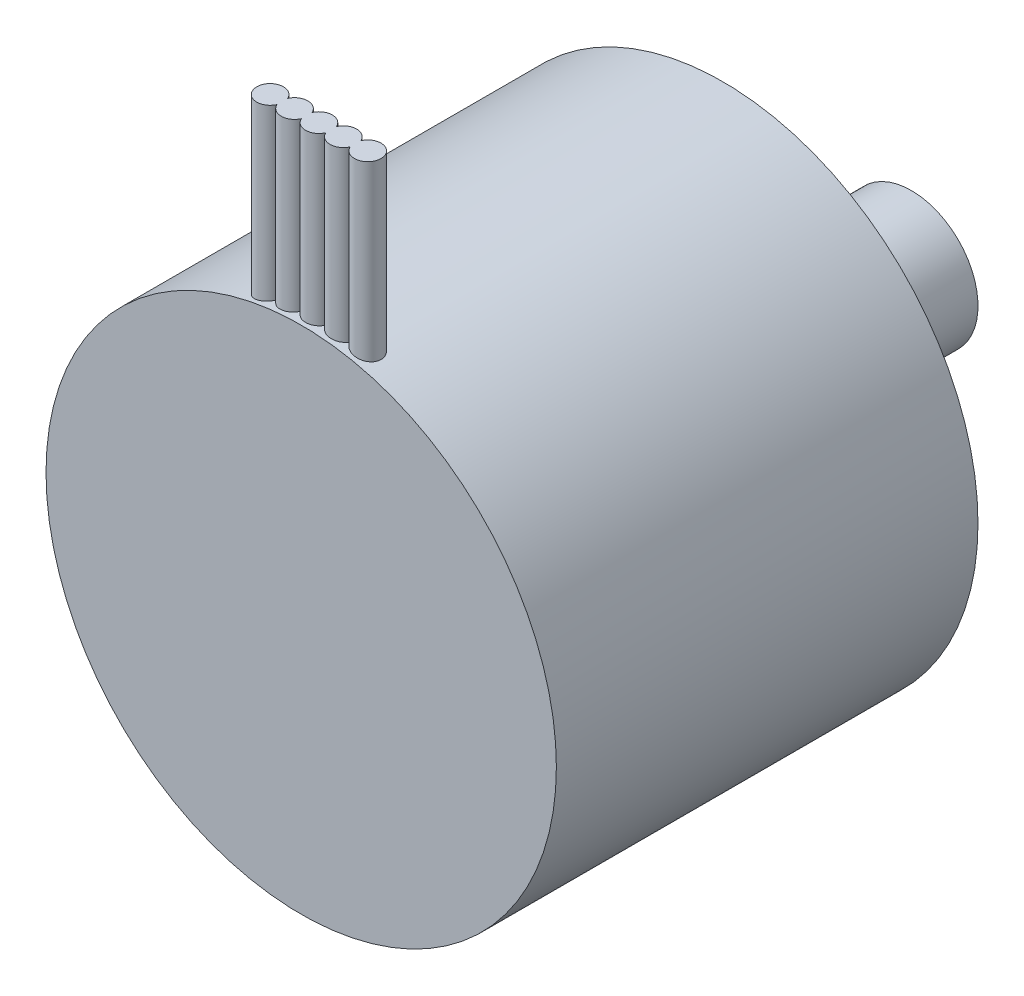
ISO-10303-21;
HEADER;
FILE_DESCRIPTION(('STEP AP214'),'2;1');
FILE_NAME('part.step','',(''),(''),'','','');
FILE_SCHEMA(('AUTOMOTIVE_DESIGN { 1 0 10303 214 1 1 1 1 }'));
ENDSEC;
DATA;
#1=APPLICATION_CONTEXT('core data for automotive mechanical design processes');
#2=APPLICATION_PROTOCOL_DEFINITION('international standard','automotive_design',2000,#1);
#3=PRODUCT_CONTEXT('',#1,'mechanical');
#4=PRODUCT('Part','Part','',(#3));
#5=PRODUCT_RELATED_PRODUCT_CATEGORY('part','',(#4));
#6=PRODUCT_DEFINITION_FORMATION('','',#4);
#7=PRODUCT_DEFINITION_CONTEXT('part definition',#1,'design');
#8=PRODUCT_DEFINITION('design','',#6,#7);
#9=PRODUCT_DEFINITION_SHAPE('','',#8);
#10=(LENGTH_UNIT() NAMED_UNIT(*) SI_UNIT(.MILLI.,.METRE.));
#11=(NAMED_UNIT(*) PLANE_ANGLE_UNIT() SI_UNIT($,.RADIAN.));
#12=(NAMED_UNIT(*) SI_UNIT($,.STERADIAN.) SOLID_ANGLE_UNIT());
#13=UNCERTAINTY_MEASURE_WITH_UNIT(LENGTH_MEASURE(1.E-05),#10,'distance_accuracy_value','');
#14=(GEOMETRIC_REPRESENTATION_CONTEXT(3) GLOBAL_UNCERTAINTY_ASSIGNED_CONTEXT((#13)) GLOBAL_UNIT_ASSIGNED_CONTEXT((#10,
#11,#12)) REPRESENTATION_CONTEXT('',''));
#15=CARTESIAN_POINT('',(0.,0.,0.));
#16=DIRECTION('',(0.,0.,1.));
#17=DIRECTION('',(1.,0.,0.));
#18=AXIS2_PLACEMENT_3D('',#15,#16,#17);
#19=CARTESIAN_POINT('',(0.,0.,19.));
#20=DIRECTION('',(0.,0.,-1.));
#21=DIRECTION('',(-1.,0.,0.));
#22=AXIS2_PLACEMENT_3D('',#19,#20,#21);
#23=CYLINDRICAL_SURFACE('',#22,11.5);
#24=CARTESIAN_POINT('',(0.,0.,0.));
#25=DIRECTION('',(0.,0.,1.));
#26=DIRECTION('',(1.,0.,0.));
#27=AXIS2_PLACEMENT_3D('',#24,#25,#26);
#28=CIRCLE('',#27,11.5);
#29=CARTESIAN_POINT('',(11.5,0.,0.));
#30=VERTEX_POINT('',#29);
#31=EDGE_CURVE('E138',#30,#30,#28,.T.);
#32=ORIENTED_EDGE('',*,*,#31,.T.);
#33=EDGE_LOOP('',(#32));
#34=FACE_BOUND('',#33,.T.);
#35=CARTESIAN_POINT('',(0.,0.,19.));
#36=DIRECTION('',(0.,0.,1.));
#37=DIRECTION('',(1.,0.,0.));
#38=AXIS2_PLACEMENT_3D('',#35,#36,#37);
#39=CIRCLE('',#38,11.5);
#40=CARTESIAN_POINT('',(11.5,0.,19.));
#41=VERTEX_POINT('',#40);
#42=EDGE_CURVE('E181',#41,#41,#39,.T.);
#43=ORIENTED_EDGE('',*,*,#42,.F.);
#44=EDGE_LOOP('',(#43));
#45=FACE_BOUND('',#44,.T.);
#46=CARTESIAN_POINT('',(1.65,11.3810148932334,17.9602084238344));
#47=CARTESIAN_POINT('',(1.63651056542803,11.3829693596623,17.9291980790824));
#48=CARTESIAN_POINT('',(1.62036474336737,11.3852870505191,17.8993843184491));
#49=CARTESIAN_POINT('',(1.58335948605389,11.3904928713383,17.8429397037249));
#50=CARTESIAN_POINT('',(1.5625050012942,11.3933804017964,17.8163055513636));
#51=CARTESIAN_POINT('',(1.5166458096318,11.3995753144329,17.7669363125672));
#52=CARTESIAN_POINT('',(1.49164017930432,11.4028827899899,17.7442020959683));
#53=CARTESIAN_POINT('',(1.43819961197656,11.4097461423727,17.703257154698));
#54=CARTESIAN_POINT('',(1.40976488723561,11.4133020038177,17.6850461502552));
#55=CARTESIAN_POINT('',(1.35007627286298,11.4205167041181,17.653550101044));
#56=CARTESIAN_POINT('',(1.31880645075634,11.4241760338272,17.6402953530532));
#57=CARTESIAN_POINT('',(1.25446975265912,11.4314195519542,17.6192376917162));
#58=CARTESIAN_POINT('',(1.22140266456924,11.4350037314341,17.6114354233413));
#59=CARTESIAN_POINT('',(1.15433193256776,11.4419690824473,17.6015020861086));
#60=CARTESIAN_POINT('',(1.12032642471005,11.4453498000644,17.5993832694071));
#61=CARTESIAN_POINT('',(1.05241656285439,11.4517938626283,17.6009263308324));
#62=CARTESIAN_POINT('',(1.01851220636042,11.4548572154703,17.6045880651167));
#63=CARTESIAN_POINT('',(0.951896634552688,11.460584936259,17.617580064997));
#64=CARTESIAN_POINT('',(0.919181656319422,11.4632506640171,17.6268904324496));
#65=CARTESIAN_POINT('',(0.855766016271895,11.4681592525024,17.6509106016823));
#66=CARTESIAN_POINT('',(0.82506517342425,11.470402151268,17.6656199174114));
#67=CARTESIAN_POINT('',(0.766706926510004,11.4744504650955,17.699943595488));
#68=CARTESIAN_POINT('',(0.739035804461484,11.476257900694,17.7195344106815));
#69=CARTESIAN_POINT('',(0.687367409439649,11.4794684847104,17.7631063289512));
#70=CARTESIAN_POINT('',(0.663369811311091,11.4808716689196,17.7870870430504));
#71=CARTESIAN_POINT('',(0.622848107679739,11.4831360853197,17.8350791646868));
#72=CARTESIAN_POINT('',(0.605746803271811,11.4840459485064,17.8586042064817));
#73=CARTESIAN_POINT('',(0.575114791061461,11.4856202650108,17.9078684406193));
#74=CARTESIAN_POINT('',(0.5615827066616,11.4862848129827,17.9336067742329));
#75=CARTESIAN_POINT('',(0.55,11.4868402966177,17.9602084238344));
#76=B_SPLINE_CURVE_WITH_KNOTS('',3,(#46,#47,#48,#49,#50,#51,#52,#53,#54,#55,#56,#57,#58,#59,#60,
#61,#62,#63,#64,#65,#66,#67,#68,#69,#70,#71,#72,#73,#74,#75),.UNSPECIFIED.,.F.,.F.,(4,2,2,2,2,2,
2,2,2,2,2,2,2,2,4),(0.,0.101475953573611,0.202845712249013,0.304238050977579,0.405624116785909,
0.507620182390385,0.60962831102041,0.711856168597291,0.814081482390005,0.915948766524672,
1.01780688210181,1.11918286160528,1.22054986280466,1.30754558390493,1.3945077027654),.UNSPECIFIED.);
#77=CARTESIAN_POINT('',(1.65,11.3810148932334,17.9602084238344));
#78=VERTEX_POINT('',#77);
#79=CARTESIAN_POINT('',(0.55,11.4868402966177,17.9602084238344));
#80=VERTEX_POINT('',#79);
#81=EDGE_CURVE('E63',#78,#80,#76,.T.);
#82=ORIENTED_EDGE('',*,*,#81,.F.);
#83=CARTESIAN_POINT('',(1.65,11.3810148932334,18.4397915761656));
#84=CARTESIAN_POINT('',(1.66344229992542,11.3790648384656,18.4706986850278));
#85=CARTESIAN_POINT('',(1.67952626505409,11.3767100802121,18.5004139926008));
#86=CARTESIAN_POINT('',(1.71635948330238,11.3712120220183,18.5566663640051));
#87=CARTESIAN_POINT('',(1.73710309420314,11.368069675216,18.5832072126186));
#88=CARTESIAN_POINT('',(1.78267874067164,11.3610116047873,18.6324005259731));
#89=CARTESIAN_POINT('',(1.80751183789152,11.3570956802833,18.6550519778788));
#90=CARTESIAN_POINT('',(1.86051858869364,11.3485325382872,18.6958531402486));
#91=CARTESIAN_POINT('',(1.88869202685903,11.3438853679466,18.7140031407758));
#92=CARTESIAN_POINT('',(1.9477991714114,11.3338864652463,18.7454579963268));
#93=CARTESIAN_POINT('',(1.97875275220364,11.3285295041335,18.7587238259027));
#94=CARTESIAN_POINT('',(2.04234749647113,11.3172372700338,18.7798871605883));
#95=CARTESIAN_POINT('',(2.07498900077875,11.3113018800324,18.7877835768935));
#96=CARTESIAN_POINT('',(2.14153473781956,11.2988933377569,18.7981071017805));
#97=CARTESIAN_POINT('',(2.17545048329439,11.2924135579915,18.800452027269));
#98=CARTESIAN_POINT('',(2.2431346721588,11.2791638176381,18.7994040441053));
#99=CARTESIAN_POINT('',(2.27690311101752,11.2723938481927,18.7960109601935));
#100=CARTESIAN_POINT('',(2.34382529850021,11.2586706890876,18.7835140200067));
#101=CARTESIAN_POINT('',(2.37696439836457,11.2517162598379,18.7743329667433));
#102=CARTESIAN_POINT('',(2.44122101776647,11.2379500181672,18.7504429921716));
#103=CARTESIAN_POINT('',(2.47233839100896,11.231138216091,18.7357336713511));
#104=CARTESIAN_POINT('',(2.53176640214614,11.2178915009288,18.7011160818895));
#105=CARTESIAN_POINT('',(2.56006757152023,11.2114578871947,18.681191041588));
#106=CARTESIAN_POINT('',(2.61291056070681,11.1992604690711,18.6366895645531));
#107=CARTESIAN_POINT('',(2.63745261713549,11.193496622529,18.6121134207998));
#108=CARTESIAN_POINT('',(2.68170105326908,11.18297772646,18.5593506203076));
#109=CARTESIAN_POINT('',(2.70147043537564,11.1782096603722,18.5312194449784));
#110=CARTESIAN_POINT('',(2.73597230092722,11.1698152297777,18.4718664270753));
#111=CARTESIAN_POINT('',(2.75070561850042,11.1661886762091,18.4406450974324));
#112=CARTESIAN_POINT('',(2.7743108911185,11.1603469401384,18.3768937558467));
#113=CARTESIAN_POINT('',(2.78332919596514,11.1580965742588,18.3444211512713));
#114=CARTESIAN_POINT('',(2.79580932868463,11.1549761259723,18.2783620164603));
#115=CARTESIAN_POINT('',(2.7992720172524,11.1541058297605,18.244775659594));
#116=CARTESIAN_POINT('',(2.80050723285489,11.1537957381281,18.1782528936151));
#117=CARTESIAN_POINT('',(2.79840632750044,11.1543241236276,18.1453189093113));
#118=CARTESIAN_POINT('',(2.78885398570113,11.1567162419673,18.0802880039513));
#119=CARTESIAN_POINT('',(2.7814027366375,11.1585799280422,18.0481910536212));
#120=CARTESIAN_POINT('',(2.76141959667741,11.1635418480426,17.9858074169596));
#121=CARTESIAN_POINT('',(2.7488995977097,11.1666371920531,17.9555166825553));
#122=CARTESIAN_POINT('',(2.71917342846437,11.173912876858,17.8974732528156));
#123=CARTESIAN_POINT('',(2.7019668648378,11.1780933087237,17.86972077078));
#124=CARTESIAN_POINT('',(2.66300959141458,11.1874388271191,17.8169624545735));
#125=CARTESIAN_POINT('',(2.6411785177723,11.1926211631809,17.7920190567439));
#126=CARTESIAN_POINT('',(2.59381178935245,11.2036927407746,17.7461275989345));
#127=CARTESIAN_POINT('',(2.56827562259964,11.2095820799818,17.7251800920403));
#128=CARTESIAN_POINT('',(2.51346277646668,11.2220013534939,17.687280774527));
#129=CARTESIAN_POINT('',(2.48410342729018,11.2285443303618,17.6704527531423));
#130=CARTESIAN_POINT('',(2.42302575862819,11.2418825270155,17.6419719672293));
#131=CARTESIAN_POINT('',(2.39130716976293,11.2486777755614,17.6303197947456));
#132=CARTESIAN_POINT('',(2.32576471085907,11.2624135620906,17.6123272751701));
#133=CARTESIAN_POINT('',(2.2919126881952,11.2693544553059,17.6060895592883));
#134=CARTESIAN_POINT('',(2.22359850349657,11.2830325287298,17.5994828938926));
#135=CARTESIAN_POINT('',(2.18913631917925,11.2897697014743,17.599114159153));
#136=CARTESIAN_POINT('',(2.12052062868591,11.3028586758396,17.6042914500769));
#137=CARTESIAN_POINT('',(2.08636775672037,11.3092097934182,17.6098476686478));
#138=CARTESIAN_POINT('',(2.01943320016402,11.3213535778839,17.6267749535784));
#139=CARTESIAN_POINT('',(1.98665131883435,11.3271463250547,17.6381451825015));
#140=CARTESIAN_POINT('',(1.92381342123104,11.3379869335287,17.6662475011411));
#141=CARTESIAN_POINT('',(1.89372987944143,11.3430427545002,17.6829149542646));
#142=CARTESIAN_POINT('',(1.83675700058505,11.3524076186284,17.7212174933334));
#143=CARTESIAN_POINT('',(1.8098689518151,11.3567163609115,17.7428545725959));
#144=CARTESIAN_POINT('',(1.76049903935549,11.3644735837132,17.7901327705153));
#145=CARTESIAN_POINT('',(1.73795898141712,11.3679336235531,17.8157113353224));
#146=CARTESIAN_POINT('',(1.6975340683433,11.3740405103023,17.8703374338308));
#147=CARTESIAN_POINT('',(1.67963900218729,11.376689143268,17.8993771501458));
#148=CARTESIAN_POINT('',(1.65926685557354,11.3796686452139,17.9397395994931));
#149=CARTESIAN_POINT('',(1.6544867651075,11.3803643155612,17.9499117807123));
#150=CARTESIAN_POINT('',(1.65,11.3810148932334,17.9602084238344));
#151=B_SPLINE_CURVE_WITH_KNOTS('',3,(#83,#84,#85,#86,#87,#88,#89,#90,#91,#92,#93,#94,#95,#96,
#97,#98,#99,#100,#101,#102,#103,#104,#105,#106,#107,#108,#109,#110,#111,#112,#113,#114,#115,
#116,#117,#118,#119,#120,#121,#122,#123,#124,#125,#126,#127,#128,#129,#130,#131,#132,#133,#134,
#135,#136,#137,#138,#139,#140,#141,#142,#143,#144,#145,#146,#147,#148,#149,#150),.UNSPECIFIED.,
.F.,.F.,(4,2,2,2,2,2,2,2,2,2,2,2,2,2,2,2,2,2,2,2,2,2,2,2,2,2,2,2,2,2,2,2,2,4),(0.,
0.1011369679859,0.202152126286194,0.303193550112776,0.404228461371054,0.506053987521827,
0.60790015560039,0.711244854452883,0.814592709883972,0.919349003765892,1.02411286954153,
1.12921784292638,1.23431619779045,1.33794030815264,1.44154724682836,1.54238063782538,
1.64319840586224,1.74174245533254,1.840283053734,1.93859379091891,2.03691278198492,
2.13710581601049,2.23731270806635,2.34023758549344,2.44317423305497,2.54802191995898,
2.65287344373506,2.75790563874802,2.86292270942895,2.96670461827409,3.07052822696663,
3.17284760205151,3.27494010762577,3.30870294328521),.UNSPECIFIED.);
#152=CARTESIAN_POINT('',(1.65,11.3810148932334,18.4397915761656));
#153=VERTEX_POINT('',#152);
#154=EDGE_CURVE('E243',#153,#78,#151,.T.);
#155=ORIENTED_EDGE('',*,*,#154,.F.);
#156=CARTESIAN_POINT('',(0.55,11.4868402966177,18.4397915761656));
#157=CARTESIAN_POINT('',(0.563452327455333,11.4861948903482,18.4707193568855));
#158=CARTESIAN_POINT('',(0.579558434165295,11.4854014822803,18.5004774411701));
#159=CARTESIAN_POINT('',(0.616493950478571,11.483478740365,18.556857482083));
#160=CARTESIAN_POINT('',(0.637319614879326,11.4823496726596,18.5834819001141));
#161=CARTESIAN_POINT('',(0.683143590077959,11.4797141919179,18.6328605701132));
#162=CARTESIAN_POINT('',(0.708143812691492,11.478207605831,18.6556130391671));
#163=CARTESIAN_POINT('',(0.761579435793985,11.4747859589065,18.6965927508117));
#164=CARTESIAN_POINT('',(0.790014198408361,11.4728709738677,18.7148208317722));
#165=CARTESIAN_POINT('',(0.849531271812939,11.4686174401297,18.7462591467728));
#166=CARTESIAN_POINT('',(0.880615468961669,11.4662785882865,18.7594657684513));
#167=CARTESIAN_POINT('',(0.944529850617159,11.4611906257863,18.7804833394455));
#168=CARTESIAN_POINT('',(0.977360294069461,11.4584414541745,18.7882934861184));
#169=CARTESIAN_POINT('',(1.04393066388787,11.4525686254846,18.7983248552772));
#170=CARTESIAN_POINT('',(1.07767298055124,11.4494438910866,18.800529577318));
#171=CARTESIAN_POINT('',(1.14502119039699,11.4429048442973,18.7992558095771));
#172=CARTESIAN_POINT('',(1.17862708246129,11.4394905295377,18.7957772733119));
#173=CARTESIAN_POINT('',(1.24492520407926,11.4324659749859,18.7832156877035));
#174=CARTESIAN_POINT('',(1.27761217652165,11.4288548606337,18.7741053795473));
#175=CARTESIAN_POINT('',(1.34098343084697,11.4215927727291,18.7505179874037));
#176=CARTESIAN_POINT('',(1.3716677355309,11.417941799631,18.7360409645307));
#177=CARTESIAN_POINT('',(1.43027489842087,11.4107488657464,18.7020655230019));
#178=CARTESIAN_POINT('',(1.45818785477475,11.4072073249435,18.6825499368841));
#179=CARTESIAN_POINT('',(1.51033695271684,11.4004199185134,18.6390625740658));
#180=CARTESIAN_POINT('',(1.53457365905245,11.3971740075022,18.6150914830841));
#181=CARTESIAN_POINT('',(1.57571949711036,11.3915531270217,18.5668209579712));
#182=CARTESIAN_POINT('',(1.59317472232135,11.3891197373641,18.5429911321058));
#183=CARTESIAN_POINT('',(1.62442331187137,11.38470433654,18.4930074840814));
#184=CARTESIAN_POINT('',(1.63821708766908,11.3827222746587,18.4668539234955));
#185=CARTESIAN_POINT('',(1.65,11.3810148932334,18.4397915761656));
#186=B_SPLINE_CURVE_WITH_KNOTS('',3,(#156,#157,#158,#159,#160,#161,#162,#163,#164,#165,#166,
#167,#168,#169,#170,#171,#172,#173,#174,#175,#176,#177,#178,#179,#180,#181,#182,#183,#184,#185),
.UNSPECIFIED.,.F.,.F.,(4,2,2,2,2,2,2,2,2,2,2,2,2,2,4),(0.,0.101063765751285,0.202047611501576,
0.303077832141623,0.404089317869809,0.505173332857216,0.606272379302197,0.707668683857547,
0.809065817739283,0.910957617250223,1.01284825648816,1.11509074884751,1.21731751872084,
1.30591897492985,1.39451047025105),.UNSPECIFIED.);
#187=CARTESIAN_POINT('',(0.55,11.4868402966177,18.4397915761656));
#188=VERTEX_POINT('',#187);
#189=EDGE_CURVE('E245',#188,#153,#186,.T.);
#190=ORIENTED_EDGE('',*,*,#189,.F.);
#191=CARTESIAN_POINT('',(-0.55,11.4868402966177,18.4397915761656));
#192=CARTESIAN_POINT('',(-0.536532189333602,11.4874838514801,18.4707532561277));
#193=CARTESIAN_POINT('',(-0.520405769951344,11.4882337109552,18.5005436876358));
#194=CARTESIAN_POINT('',(-0.483413629340317,11.4898503389264,18.5569870172404));
#195=CARTESIAN_POINT('',(-0.46255140225074,11.4907170210387,18.5836422066557));
#196=CARTESIAN_POINT('',(-0.416633838511584,11.4924732124585,18.6330788686461));
#197=CARTESIAN_POINT('',(-0.391576633146125,11.4933627317891,18.6558586056841));
#198=CARTESIAN_POINT('',(-0.337997577419498,11.4950630838378,18.6968855738068));
#199=CARTESIAN_POINT('',(-0.309476374566892,11.4958739312109,18.7151336500375));
#200=CARTESIAN_POINT('',(-0.249767575641643,11.4973260680031,18.7465848645432));
#201=CARTESIAN_POINT('',(-0.218579674335311,11.4979673379778,18.7597874243535));
#202=CARTESIAN_POINT('',(-0.154421768086001,11.4990078962522,18.7807694238374));
#203=CARTESIAN_POINT('',(-0.121451542122177,11.4994071544655,18.7885481892523));
#204=CARTESIAN_POINT('',(-0.0547098620802767,11.4999182087301,18.7984510361881));
#205=CARTESIAN_POINT('',(-0.0209393916139761,11.5000303409054,18.8005817297266));
#206=CARTESIAN_POINT('',(0.0464793222202797,11.4999554789151,18.7991464527987));
#207=CARTESIAN_POINT('',(0.080127568006014,11.499768490699,18.79558059564));
#208=CARTESIAN_POINT('',(0.146323460778326,11.4991166981816,18.7828590218384));
#209=CARTESIAN_POINT('',(0.178871838206144,11.498652082247,18.7737070951834));
#210=CARTESIAN_POINT('',(0.241968233554561,11.4974974570545,18.7500783087119));
#211=CARTESIAN_POINT('',(0.272516372580988,11.4968074614575,18.7356017716295));
#212=CARTESIAN_POINT('',(0.330775033325816,11.4952789919846,18.7017214569419));
#213=CARTESIAN_POINT('',(0.358483119183006,11.4944403923082,18.6823134985614));
#214=CARTESIAN_POINT('',(0.410252159831679,11.492709193496,18.6391234611947));
#215=CARTESIAN_POINT('',(0.434313254763022,11.491816596437,18.6153415503603));
#216=CARTESIAN_POINT('',(0.475421855439108,11.490184804362,18.5672177975015));
#217=CARTESIAN_POINT('',(0.492966991991431,11.4894401852653,18.5432987853693));
#218=CARTESIAN_POINT('',(0.524350190506809,11.4880502306895,18.4931489717576));
#219=CARTESIAN_POINT('',(0.538189317501342,11.4874048667091,18.4669188373335));
#220=CARTESIAN_POINT('',(0.550000000000001,11.4868402966177,18.4397915761656));
#221=B_SPLINE_CURVE_WITH_KNOTS('',3,(#191,#192,#193,#194,#195,#196,#197,#198,#199,#200,#201,
#202,#203,#204,#205,#206,#207,#208,#209,#210,#211,#212,#213,#214,#215,#216,#217,#218,#219,#220),
.UNSPECIFIED.,.F.,.F.,(4,2,2,2,2,2,2,2,2,2,2,2,2,2,4),(0.,0.101174901261503,0.202275395628015,
0.303421047146228,0.40454782100413,0.50568618549588,0.606837120758495,0.707869589446013,
0.808900048562604,0.909862037488006,1.01081790793633,1.11185965430343,1.21289751703925,
1.30160005608336,1.39027707640628),.UNSPECIFIED.);
#222=CARTESIAN_POINT('',(-0.55,11.4868402966177,18.4397915761656));
#223=VERTEX_POINT('',#222);
#224=EDGE_CURVE('E195',#223,#188,#221,.T.);
#225=ORIENTED_EDGE('',*,*,#224,.F.);
#226=CARTESIAN_POINT('',(-1.65,11.3810148932334,18.4397915761656));
#227=CARTESIAN_POINT('',(-1.63651056542803,11.3829693596623,18.4708019209176));
#228=CARTESIAN_POINT('',(-1.62036474336737,11.3852870505191,18.5006156815509));
#229=CARTESIAN_POINT('',(-1.58335948605389,11.3904928713383,18.5570602962751));
#230=CARTESIAN_POINT('',(-1.5625050012942,11.3933804017964,18.5836944486364));
#231=CARTESIAN_POINT('',(-1.5166458096318,11.3995753144329,18.6330636874328));
#232=CARTESIAN_POINT('',(-1.49164017930432,11.4028827899899,18.6557979040317));
#233=CARTESIAN_POINT('',(-1.43819961197656,11.4097461423727,18.696742845302));
#234=CARTESIAN_POINT('',(-1.40976488723561,11.4133020038177,18.7149538497448));
#235=CARTESIAN_POINT('',(-1.35007627286298,11.4205167041181,18.746449898956));
#236=CARTESIAN_POINT('',(-1.31880645075634,11.4241760338272,18.7597046469468));
#237=CARTESIAN_POINT('',(-1.25446975265912,11.4314195519542,18.7807623082838));
#238=CARTESIAN_POINT('',(-1.22140266456924,11.4350037314341,18.7885645766587));
#239=CARTESIAN_POINT('',(-1.15433193256776,11.4419690824473,18.7984979138914));
#240=CARTESIAN_POINT('',(-1.12032642471005,11.4453498000644,18.8006167305929));
#241=CARTESIAN_POINT('',(-1.05241656285439,11.4517938626283,18.7990736691676));
#242=CARTESIAN_POINT('',(-1.01851220636042,11.4548572154703,18.7954119348833));
#243=CARTESIAN_POINT('',(-0.951896634552688,11.460584936259,18.782419935003));
#244=CARTESIAN_POINT('',(-0.919181656319423,11.4632506640171,18.7731095675504));
#245=CARTESIAN_POINT('',(-0.855766016271896,11.4681592525024,18.7490893983177));
#246=CARTESIAN_POINT('',(-0.825065173424251,11.470402151268,18.7343800825886));
#247=CARTESIAN_POINT('',(-0.766706926510004,11.4744504650955,18.700056404512));
#248=CARTESIAN_POINT('',(-0.739035804461484,11.476257900694,18.6804655893185));
#249=CARTESIAN_POINT('',(-0.687367409439649,11.4794684847104,18.6368936710488));
#250=CARTESIAN_POINT('',(-0.663369811311091,11.4808716689196,18.6129129569496));
#251=CARTESIAN_POINT('',(-0.622848107679739,11.4831360853197,18.5649208353132));
#252=CARTESIAN_POINT('',(-0.605746803271811,11.4840459485064,18.5413957935183));
#253=CARTESIAN_POINT('',(-0.575114791061461,11.4856202650108,18.4921315593807));
#254=CARTESIAN_POINT('',(-0.5615827066616,11.4862848129827,18.4663932257671));
#255=CARTESIAN_POINT('',(-0.55,11.4868402966177,18.4397915761656));
#256=B_SPLINE_CURVE_WITH_KNOTS('',3,(#226,#227,#228,#229,#230,#231,#232,#233,#234,#235,#236,
#237,#238,#239,#240,#241,#242,#243,#244,#245,#246,#247,#248,#249,#250,#251,#252,#253,#254,#255),
.UNSPECIFIED.,.F.,.F.,(4,2,2,2,2,2,2,2,2,2,2,2,2,2,4),(0.,0.101475953573611,0.202845712249013,
0.304238050977579,0.405624116785909,0.507620182390384,0.609628311020409,0.711856168597291,
0.814081482390006,0.915948766524672,1.01780688210181,1.11918286160528,1.22054986280466,
1.30754558390493,1.3945077027654),.UNSPECIFIED.);
#257=CARTESIAN_POINT('',(-1.65,11.3810148932334,18.4397915761656));
#258=VERTEX_POINT('',#257);
#259=EDGE_CURVE('E185',#258,#223,#256,.T.);
#260=ORIENTED_EDGE('',*,*,#259,.F.);
#261=CARTESIAN_POINT('',(-1.65,11.3810148932334,17.9602084238344));
#262=CARTESIAN_POINT('',(-1.66344229992542,11.3790648384656,17.9293013149722));
#263=CARTESIAN_POINT('',(-1.67952626505409,11.3767100802121,17.8995860073992));
#264=CARTESIAN_POINT('',(-1.71635948330238,11.3712120220183,17.8433336359949));
#265=CARTESIAN_POINT('',(-1.73710309420314,11.368069675216,17.8167927873814));
#266=CARTESIAN_POINT('',(-1.78267874067164,11.3610116047873,17.7675994740269));
#267=CARTESIAN_POINT('',(-1.80751183789152,11.3570956802833,17.7449480221212));
#268=CARTESIAN_POINT('',(-1.86051858869364,11.3485325382872,17.7041468597514));
#269=CARTESIAN_POINT('',(-1.88869202685903,11.3438853679466,17.6859968592242));
#270=CARTESIAN_POINT('',(-1.9477991714114,11.3338864652463,17.6545420036732));
#271=CARTESIAN_POINT('',(-1.97875275220364,11.3285295041335,17.6412761740973));
#272=CARTESIAN_POINT('',(-2.04234749647113,11.3172372700338,17.6201128394117));
#273=CARTESIAN_POINT('',(-2.07498900077875,11.3113018800324,17.6122164231065));
#274=CARTESIAN_POINT('',(-2.14153473781956,11.2988933377569,17.6018928982195));
#275=CARTESIAN_POINT('',(-2.17545048329439,11.2924135579915,17.599547972731));
#276=CARTESIAN_POINT('',(-2.2431346721588,11.2791638176381,17.6005959558947));
#277=CARTESIAN_POINT('',(-2.27690311101752,11.2723938481927,17.6039890398065));
#278=CARTESIAN_POINT('',(-2.34382529850021,11.2586706890876,17.6164859799933));
#279=CARTESIAN_POINT('',(-2.37696439836457,11.2517162598379,17.6256670332567));
#280=CARTESIAN_POINT('',(-2.44122101776647,11.2379500181672,17.6495570078284));
#281=CARTESIAN_POINT('',(-2.47233839100895,11.231138216091,17.6642663286489));
#282=CARTESIAN_POINT('',(-2.53176640214614,11.2178915009288,17.6988839181105));
#283=CARTESIAN_POINT('',(-2.56006757152022,11.2114578871947,17.718808958412));
#284=CARTESIAN_POINT('',(-2.61291056070681,11.1992604690711,17.7633104354469));
#285=CARTESIAN_POINT('',(-2.63745261713549,11.193496622529,17.7878865792002));
#286=CARTESIAN_POINT('',(-2.68170105326908,11.18297772646,17.8406493796924));
#287=CARTESIAN_POINT('',(-2.70147043537564,11.1782096603722,17.8687805550216));
#288=CARTESIAN_POINT('',(-2.73597230092722,11.1698152297777,17.9281335729247));
#289=CARTESIAN_POINT('',(-2.75070561850042,11.1661886762091,17.9593549025676));
#290=CARTESIAN_POINT('',(-2.7743108911185,11.1603469401384,18.0231062441533));
#291=CARTESIAN_POINT('',(-2.78332919596514,11.1580965742588,18.0555788487287));
#292=CARTESIAN_POINT('',(-2.79580932868463,11.1549761259723,18.1216379835397));
#293=CARTESIAN_POINT('',(-2.7992720172524,11.1541058297605,18.155224340406));
#294=CARTESIAN_POINT('',(-2.80050723285489,11.1537957381281,18.2217471063849));
#295=CARTESIAN_POINT('',(-2.79840632750044,11.1543241236276,18.2546810906887));
#296=CARTESIAN_POINT('',(-2.78885398570113,11.1567162419673,18.3197119960487));
#297=CARTESIAN_POINT('',(-2.7814027366375,11.1585799280422,18.3518089463788));
#298=CARTESIAN_POINT('',(-2.76141959667741,11.1635418480426,18.4141925830404));
#299=CARTESIAN_POINT('',(-2.7488995977097,11.1666371920531,18.4444833174447));
#300=CARTESIAN_POINT('',(-2.71917342846437,11.173912876858,18.5025267471844));
#301=CARTESIAN_POINT('',(-2.7019668648378,11.1780933087237,18.53027922922));
#302=CARTESIAN_POINT('',(-2.66300959141458,11.1874388271191,18.5830375454265));
#303=CARTESIAN_POINT('',(-2.6411785177723,11.1926211631809,18.6079809432561));
#304=CARTESIAN_POINT('',(-2.59381178935245,11.2036927407746,18.6538724010655));
#305=CARTESIAN_POINT('',(-2.56827562259964,11.2095820799818,18.6748199079597));
#306=CARTESIAN_POINT('',(-2.51346277646668,11.2220013534939,18.712719225473));
#307=CARTESIAN_POINT('',(-2.48410342729018,11.2285443303618,18.7295472468577));
#308=CARTESIAN_POINT('',(-2.42302575862819,11.2418825270155,18.7580280327707));
#309=CARTESIAN_POINT('',(-2.39130716976293,11.2486777755614,18.7696802052544));
#310=CARTESIAN_POINT('',(-2.32576471085907,11.2624135620906,18.7876727248299));
#311=CARTESIAN_POINT('',(-2.2919126881952,11.2693544553059,18.7939104407117));
#312=CARTESIAN_POINT('',(-2.22359850349657,11.2830325287298,18.8005171061074));
#313=CARTESIAN_POINT('',(-2.18913631917925,11.2897697014743,18.800885840847));
#314=CARTESIAN_POINT('',(-2.12052062868591,11.3028586758396,18.7957085499231));
#315=CARTESIAN_POINT('',(-2.08636775672037,11.3092097934182,18.7901523313522));
#316=CARTESIAN_POINT('',(-2.01943320016402,11.3213535778839,18.7732250464216));
#317=CARTESIAN_POINT('',(-1.98665131883435,11.3271463250547,18.7618548174985));
#318=CARTESIAN_POINT('',(-1.92381342123104,11.3379869335287,18.7337524988589));
#319=CARTESIAN_POINT('',(-1.89372987944143,11.3430427545002,18.7170850457354));
#320=CARTESIAN_POINT('',(-1.83675700058505,11.3524076186284,18.6787825066666));
#321=CARTESIAN_POINT('',(-1.8098689518151,11.3567163609115,18.6571454274041));
#322=CARTESIAN_POINT('',(-1.76049903935549,11.3644735837132,18.6098672294847));
#323=CARTESIAN_POINT('',(-1.73795898141712,11.3679336235531,18.5842886646776));
#324=CARTESIAN_POINT('',(-1.6975340683433,11.3740405103023,18.5296625661692));
#325=CARTESIAN_POINT('',(-1.67963900218729,11.376689143268,18.5006228498542));
#326=CARTESIAN_POINT('',(-1.65926685557354,11.3796686452139,18.4602604005069));
#327=CARTESIAN_POINT('',(-1.6544867651075,11.3803643155612,18.4500882192877));
#328=CARTESIAN_POINT('',(-1.65,11.3810148932334,18.4397915761656));
#329=B_SPLINE_CURVE_WITH_KNOTS('',3,(#261,#262,#263,#264,#265,#266,#267,#268,#269,#270,#271,
#272,#273,#274,#275,#276,#277,#278,#279,#280,#281,#282,#283,#284,#285,#286,#287,#288,#289,#290,
#291,#292,#293,#294,#295,#296,#297,#298,#299,#300,#301,#302,#303,#304,#305,#306,#307,#308,#309,
#310,#311,#312,#313,#314,#315,#316,#317,#318,#319,#320,#321,#322,#323,#324,#325,#326,#327,#328),
.UNSPECIFIED.,.F.,.F.,(4,2,2,2,2,2,2,2,2,2,2,2,2,2,2,2,2,2,2,2,2,2,2,2,2,2,2,2,2,2,2,2,2,4),(0.,
0.1011369679859,0.202152126286194,0.303193550112776,0.404228461371054,0.506053987521827,
0.60790015560039,0.711244854452883,0.814592709883972,0.919349003765892,1.02411286954153,
1.12921784292638,1.23431619779045,1.33794030815264,1.44154724682836,1.54238063782538,
1.64319840586223,1.74174245533254,1.840283053734,1.93859379091891,2.03691278198492,
2.13710581601049,2.23731270806635,2.34023758549344,2.44317423305497,2.54802191995898,
2.65287344373506,2.75790563874802,2.86292270942895,2.96670461827409,3.07052822696663,
3.1728476020515,3.27494010762577,3.30870294328521),.UNSPECIFIED.);
#330=CARTESIAN_POINT('',(-1.65,11.3810148932334,17.9602084238344));
#331=VERTEX_POINT('',#330);
#332=EDGE_CURVE('E135',#331,#258,#329,.T.);
#333=ORIENTED_EDGE('',*,*,#332,.F.);
#334=CARTESIAN_POINT('',(-0.55,11.4868402966177,17.9602084238344));
#335=CARTESIAN_POINT('',(-0.563452327455333,11.4861948903482,17.9292806431145));
#336=CARTESIAN_POINT('',(-0.579558434165295,11.4854014822803,17.8995225588299));
#337=CARTESIAN_POINT('',(-0.616493950478572,11.483478740365,17.843142517917));
#338=CARTESIAN_POINT('',(-0.637319614879326,11.4823496726596,17.8165180998859));
#339=CARTESIAN_POINT('',(-0.683143590077959,11.4797141919179,17.7671394298868));
#340=CARTESIAN_POINT('',(-0.708143812691492,11.478207605831,17.7443869608329));
#341=CARTESIAN_POINT('',(-0.761579435793985,11.4747859589065,17.7034072491882));
#342=CARTESIAN_POINT('',(-0.790014198408361,11.4728709738677,17.6851791682278));
#343=CARTESIAN_POINT('',(-0.84953127181294,11.4686174401297,17.6537408532273));
#344=CARTESIAN_POINT('',(-0.88061546896167,11.4662785882865,17.6405342315487));
#345=CARTESIAN_POINT('',(-0.94452985061716,11.4611906257863,17.6195166605545));
#346=CARTESIAN_POINT('',(-0.977360294069461,11.4584414541745,17.6117065138816));
#347=CARTESIAN_POINT('',(-1.04393066388787,11.4525686254846,17.6016751447228));
#348=CARTESIAN_POINT('',(-1.07767298055124,11.4494438910866,17.599470422682));
#349=CARTESIAN_POINT('',(-1.14502119039699,11.4429048442973,17.6007441904229));
#350=CARTESIAN_POINT('',(-1.17862708246129,11.4394905295377,17.6042227266881));
#351=CARTESIAN_POINT('',(-1.24492520407926,11.4324659749859,17.6167843122965));
#352=CARTESIAN_POINT('',(-1.27761217652165,11.4288548606337,17.6258946204527));
#353=CARTESIAN_POINT('',(-1.34098343084697,11.4215927727291,17.6494820125963));
#354=CARTESIAN_POINT('',(-1.3716677355309,11.417941799631,17.6639590354694));
#355=CARTESIAN_POINT('',(-1.43027489842087,11.4107488657464,17.6979344769981));
#356=CARTESIAN_POINT('',(-1.45818785477475,11.4072073249435,17.7174500631159));
#357=CARTESIAN_POINT('',(-1.51033695271684,11.4004199185134,17.7609374259342));
#358=CARTESIAN_POINT('',(-1.53457365905245,11.3971740075022,17.7849085169159));
#359=CARTESIAN_POINT('',(-1.57571949711036,11.3915531270217,17.8331790420288));
#360=CARTESIAN_POINT('',(-1.59317472232135,11.3891197373641,17.8570088678942));
#361=CARTESIAN_POINT('',(-1.62442331187137,11.38470433654,17.9069925159186));
#362=CARTESIAN_POINT('',(-1.63821708766908,11.3827222746587,17.9331460765045));
#363=CARTESIAN_POINT('',(-1.65,11.3810148932334,17.9602084238344));
#364=B_SPLINE_CURVE_WITH_KNOTS('',3,(#334,#335,#336,#337,#338,#339,#340,#341,#342,#343,#344,
#345,#346,#347,#348,#349,#350,#351,#352,#353,#354,#355,#356,#357,#358,#359,#360,#361,#362,#363),
.UNSPECIFIED.,.F.,.F.,(4,2,2,2,2,2,2,2,2,2,2,2,2,2,4),(0.,0.101063765751285,0.202047611501576,
0.303077832141623,0.404089317869809,0.505173332857219,0.606272379302198,0.707668683857547,
0.809065817739283,0.910957617250224,1.01284825648816,1.11509074884751,1.21731751872084,
1.30591897492985,1.39451047025105),.UNSPECIFIED.);
#365=CARTESIAN_POINT('',(-0.55,11.4868402966177,17.9602084238344));
#366=VERTEX_POINT('',#365);
#367=EDGE_CURVE('E85',#366,#331,#364,.T.);
#368=ORIENTED_EDGE('',*,*,#367,.F.);
#369=CARTESIAN_POINT('',(0.55,11.4868402966177,17.9602084238344));
#370=CARTESIAN_POINT('',(0.536532189333601,11.4874838514801,17.9292467438723));
#371=CARTESIAN_POINT('',(0.520405769951342,11.4882337109552,17.8994563123642));
#372=CARTESIAN_POINT('',(0.483413629340316,11.4898503389264,17.8430129827596));
#373=CARTESIAN_POINT('',(0.46255140225074,11.4907170210387,17.8163577933443));
#374=CARTESIAN_POINT('',(0.416633838511584,11.4924732124585,17.7669211313539));
#375=CARTESIAN_POINT('',(0.391576633146123,11.4933627317891,17.7441413943159));
#376=CARTESIAN_POINT('',(0.337997577419496,11.4950630838378,17.7031144261932));
#377=CARTESIAN_POINT('',(0.30947637456689,11.4958739312109,17.6848663499625));
#378=CARTESIAN_POINT('',(0.249767575641643,11.4973260680031,17.6534151354568));
#379=CARTESIAN_POINT('',(0.218579674335311,11.4979673379778,17.6402125756465));
#380=CARTESIAN_POINT('',(0.154421768086,11.4990078962522,17.6192305761626));
#381=CARTESIAN_POINT('',(0.121451542122176,11.4994071544655,17.6114518107477));
#382=CARTESIAN_POINT('',(0.0547098620802746,11.4999182087301,17.6015489638119));
#383=CARTESIAN_POINT('',(0.020939391613974,11.5000303409054,17.5994182702734));
#384=CARTESIAN_POINT('',(-0.0464793222202822,11.4999554789151,17.6008535472013));
#385=CARTESIAN_POINT('',(-0.0801275680060167,11.499768490699,17.60441940436));
#386=CARTESIAN_POINT('',(-0.146323460778329,11.4991166981816,17.6171409781616));
#387=CARTESIAN_POINT('',(-0.178871838206146,11.498652082247,17.6262929048166));
#388=CARTESIAN_POINT('',(-0.241968233554563,11.4974974570545,17.6499216912881));
#389=CARTESIAN_POINT('',(-0.27251637258099,11.4968074614575,17.6643982283705));
#390=CARTESIAN_POINT('',(-0.330775033325817,11.4952789919846,17.6982785430581));
#391=CARTESIAN_POINT('',(-0.358483119183008,11.4944403923082,17.7176865014386));
#392=CARTESIAN_POINT('',(-0.410252159831681,11.492709193496,17.7608765388053));
#393=CARTESIAN_POINT('',(-0.434313254763024,11.491816596437,17.7846584496397));
#394=CARTESIAN_POINT('',(-0.475421855439109,11.490184804362,17.8327822024985));
#395=CARTESIAN_POINT('',(-0.492966991991432,11.4894401852653,17.8567012146307));
#396=CARTESIAN_POINT('',(-0.524350190506809,11.4880502306895,17.9068510282424));
#397=CARTESIAN_POINT('',(-0.538189317501341,11.4874048667091,17.9330811626665));
#398=CARTESIAN_POINT('',(-0.55,11.4868402966177,17.9602084238344));
#399=B_SPLINE_CURVE_WITH_KNOTS('',3,(#369,#370,#371,#372,#373,#374,#375,#376,#377,#378,#379,
#380,#381,#382,#383,#384,#385,#386,#387,#388,#389,#390,#391,#392,#393,#394,#395,#396,#397,#398),
.UNSPECIFIED.,.F.,.F.,(4,2,2,2,2,2,2,2,2,2,2,2,2,2,4),(0.,0.101174901261507,0.202275395628018,
0.303421047146234,0.404547821004131,0.505686185495882,0.606837120758498,0.707869589446016,
0.808900048562607,0.909862037488008,1.01081790793634,1.11185965430343,1.21289751703926,
1.30160005608337,1.39027707640628),.UNSPECIFIED.);
#400=EDGE_CURVE('E80',#80,#366,#399,.T.);
#401=ORIENTED_EDGE('',*,*,#400,.F.);
#402=EDGE_LOOP('',(#82,#155,#190,#225,#260,#333,#368,#401));
#403=FACE_BOUND('',#402,.T.);
#404=ADVANCED_FACE('F59',(#34,#45,#403),#23,.T.);
#405=CARTESIAN_POINT('',(0.,0.,19.));
#406=DIRECTION('',(0.,0.,1.));
#407=DIRECTION('',(1.,0.,0.));
#408=AXIS2_PLACEMENT_3D('',#405,#406,#407);
#409=PLANE('',#408);
#410=ORIENTED_EDGE('',*,*,#42,.T.);
#411=EDGE_LOOP('',(#410));
#412=FACE_BOUND('',#411,.T.);
#413=ADVANCED_FACE('F260',(#412),#409,.T.);
#414=CARTESIAN_POINT('',(0.,0.,0.));
#415=DIRECTION('',(0.,0.,1.));
#416=DIRECTION('',(1.,0.,0.));
#417=AXIS2_PLACEMENT_3D('',#414,#415,#416);
#418=PLANE('',#417);
#419=CARTESIAN_POINT('',(0.,-8.5,0.));
#420=DIRECTION('',(0.,0.,-1.));
#421=DIRECTION('',(-1.,0.,0.));
#422=AXIS2_PLACEMENT_3D('',#419,#420,#421);
#423=CIRCLE('',#422,1.);
#424=CARTESIAN_POINT('',(-1.,-8.5,0.));
#425=VERTEX_POINT('',#424);
#426=EDGE_CURVE('E308',#425,#425,#423,.T.);
#427=ORIENTED_EDGE('',*,*,#426,.F.);
#428=EDGE_LOOP('',(#427));
#429=FACE_BOUND('',#428,.T.);
#430=CARTESIAN_POINT('',(0.,8.5,0.));
#431=DIRECTION('',(0.,0.,-1.));
#432=DIRECTION('',(-1.,0.,0.));
#433=AXIS2_PLACEMENT_3D('',#430,#431,#432);
#434=CIRCLE('',#433,1.);
#435=CARTESIAN_POINT('',(-1.,8.5,0.));
#436=VERTEX_POINT('',#435);
#437=EDGE_CURVE('E313',#436,#436,#434,.T.);
#438=ORIENTED_EDGE('',*,*,#437,.F.);
#439=EDGE_LOOP('',(#438));
#440=FACE_BOUND('',#439,.T.);
#441=CARTESIAN_POINT('',(0.,0.,0.));
#442=DIRECTION('',(0.,0.,-1.));
#443=DIRECTION('',(-1.,0.,0.));
#444=AXIS2_PLACEMENT_3D('',#441,#442,#443);
#445=CIRCLE('',#444,3.);
#446=CARTESIAN_POINT('',(-3.,0.,0.));
#447=VERTEX_POINT('',#446);
#448=EDGE_CURVE('E12',#447,#447,#445,.T.);
#449=ORIENTED_EDGE('',*,*,#448,.F.);
#450=EDGE_LOOP('',(#449));
#451=FACE_BOUND('',#450,.T.);
#452=ORIENTED_EDGE('',*,*,#31,.F.);
#453=EDGE_LOOP('',(#452));
#454=FACE_BOUND('',#453,.T.);
#455=ADVANCED_FACE('F262',(#429,#440,#451,#454),#418,.F.);
#456=CARTESIAN_POINT('',(-2.2,19.,18.2));
#457=DIRECTION('',(0.,-1.,0.));
#458=DIRECTION('',(0.,0.,-1.));
#459=AXIS2_PLACEMENT_3D('',#456,#457,#458);
#460=CYLINDRICAL_SURFACE('',#459,0.6);
#461=DIRECTION('',(0.,-1.,0.));
#462=VECTOR('',#461,1.);
#463=CARTESIAN_POINT('',(-1.65,9.5,17.9602084238344));
#464=LINE('',#463,#462);
#465=CARTESIAN_POINT('',(-1.65,19.,17.9602084238344));
#466=VERTEX_POINT('',#465);
#467=EDGE_CURVE('E139',#331,#466,#464,.F.);
#468=ORIENTED_EDGE('',*,*,#467,.F.);
#469=ORIENTED_EDGE('',*,*,#332,.T.);
#470=DIRECTION('',(0.,-1.,0.));
#471=VECTOR('',#470,1.);
#472=CARTESIAN_POINT('',(-1.65,9.5,18.4397915761656));
#473=LINE('',#472,#471);
#474=CARTESIAN_POINT('',(-1.65,19.,18.4397915761656));
#475=VERTEX_POINT('',#474);
#476=EDGE_CURVE('E129',#475,#258,#473,.T.);
#477=ORIENTED_EDGE('',*,*,#476,.F.);
#478=CARTESIAN_POINT('',(-2.2,19.,18.2));
#479=DIRECTION('',(0.,1.,0.));
#480=DIRECTION('',(0.,0.,1.));
#481=AXIS2_PLACEMENT_3D('',#478,#479,#480);
#482=CIRCLE('',#481,0.6);
#483=EDGE_CURVE('E134',#466,#475,#482,.T.);
#484=ORIENTED_EDGE('',*,*,#483,.F.);
#485=EDGE_LOOP('',(#468,#469,#477,#484));
#486=FACE_BOUND('',#485,.T.);
#487=ADVANCED_FACE('F132',(#486),#460,.T.);
#488=CARTESIAN_POINT('',(2.2,19.,18.2));
#489=DIRECTION('',(0.,-1.,0.));
#490=DIRECTION('',(0.,0.,-1.));
#491=AXIS2_PLACEMENT_3D('',#488,#489,#490);
#492=CYLINDRICAL_SURFACE('',#491,0.6);
#493=DIRECTION('',(0.,-1.,0.));
#494=VECTOR('',#493,1.);
#495=CARTESIAN_POINT('',(1.65,9.5,18.4397915761656));
#496=LINE('',#495,#494);
#497=CARTESIAN_POINT('',(1.65,19.,18.4397915761656));
#498=VERTEX_POINT('',#497);
#499=EDGE_CURVE('E164',#498,#153,#496,.T.);
#500=ORIENTED_EDGE('',*,*,#499,.T.);
#501=ORIENTED_EDGE('',*,*,#154,.T.);
#502=DIRECTION('',(0.,-1.,0.));
#503=VECTOR('',#502,1.);
#504=CARTESIAN_POINT('',(1.65,9.5,17.9602084238344));
#505=LINE('',#504,#503);
#506=CARTESIAN_POINT('',(1.65,19.,17.9602084238344));
#507=VERTEX_POINT('',#506);
#508=EDGE_CURVE('E172',#78,#507,#505,.F.);
#509=ORIENTED_EDGE('',*,*,#508,.T.);
#510=CARTESIAN_POINT('',(2.2,19.,18.2));
#511=DIRECTION('',(0.,1.,0.));
#512=DIRECTION('',(0.,0.,1.));
#513=AXIS2_PLACEMENT_3D('',#510,#511,#512);
#514=CIRCLE('',#513,0.6);
#515=EDGE_CURVE('E168',#498,#507,#514,.T.);
#516=ORIENTED_EDGE('',*,*,#515,.F.);
#517=EDGE_LOOP('',(#500,#501,#509,#516));
#518=FACE_BOUND('',#517,.T.);
#519=ADVANCED_FACE('F242',(#518),#492,.T.);
#520=CARTESIAN_POINT('',(1.1,19.,18.2));
#521=DIRECTION('',(0.,-1.,0.));
#522=DIRECTION('',(0.,0.,-1.));
#523=AXIS2_PLACEMENT_3D('',#520,#521,#522);
#524=CYLINDRICAL_SURFACE('',#523,0.6);
#525=DIRECTION('',(0.,-1.,0.));
#526=VECTOR('',#525,1.);
#527=CARTESIAN_POINT('',(0.55,9.5,18.4397915761656));
#528=LINE('',#527,#526);
#529=CARTESIAN_POINT('',(0.55,19.,18.4397915761656));
#530=VERTEX_POINT('',#529);
#531=EDGE_CURVE('E149',#530,#188,#528,.T.);
#532=ORIENTED_EDGE('',*,*,#531,.T.);
#533=ORIENTED_EDGE('',*,*,#189,.T.);
#534=ORIENTED_EDGE('',*,*,#499,.F.);
#535=CARTESIAN_POINT('',(1.1,19.,18.2));
#536=DIRECTION('',(0.,1.,0.));
#537=DIRECTION('',(0.,0.,1.));
#538=AXIS2_PLACEMENT_3D('',#535,#536,#537);
#539=CIRCLE('',#538,0.6);
#540=EDGE_CURVE('E165',#530,#498,#539,.T.);
#541=ORIENTED_EDGE('',*,*,#540,.F.);
#542=EDGE_LOOP('',(#532,#533,#534,#541));
#543=FACE_BOUND('',#542,.T.);
#544=ADVANCED_FACE('F258',(#543),#524,.T.);
#545=ORIENTED_EDGE('',*,*,#508,.F.);
#546=ORIENTED_EDGE('',*,*,#81,.T.);
#547=DIRECTION('',(0.,-1.,0.));
#548=VECTOR('',#547,1.);
#549=CARTESIAN_POINT('',(0.55,9.5,17.9602084238344));
#550=LINE('',#549,#548);
#551=CARTESIAN_POINT('',(0.55,19.,17.9602084238344));
#552=VERTEX_POINT('',#551);
#553=EDGE_CURVE('E176',#80,#552,#550,.F.);
#554=ORIENTED_EDGE('',*,*,#553,.T.);
#555=EDGE_CURVE('E167',#507,#552,#539,.T.);
#556=ORIENTED_EDGE('',*,*,#555,.F.);
#557=EDGE_LOOP('',(#545,#546,#554,#556));
#558=FACE_BOUND('',#557,.T.);
#559=ADVANCED_FACE('F233',(#558),#524,.T.);
#560=CARTESIAN_POINT('',(0.,19.,18.2));
#561=DIRECTION('',(0.,-1.,0.));
#562=DIRECTION('',(0.,0.,-1.));
#563=AXIS2_PLACEMENT_3D('',#560,#561,#562);
#564=CYLINDRICAL_SURFACE('',#563,0.6);
#565=DIRECTION('',(0.,-1.,0.));
#566=VECTOR('',#565,1.);
#567=CARTESIAN_POINT('',(-0.55,9.5,18.4397915761656));
#568=LINE('',#567,#566);
#569=CARTESIAN_POINT('',(-0.55,19.,18.4397915761656));
#570=VERTEX_POINT('',#569);
#571=EDGE_CURVE('E145',#570,#223,#568,.T.);
#572=ORIENTED_EDGE('',*,*,#571,.T.);
#573=ORIENTED_EDGE('',*,*,#224,.T.);
#574=ORIENTED_EDGE('',*,*,#531,.F.);
#575=CARTESIAN_POINT('',(0.,19.,18.2));
#576=DIRECTION('',(0.,1.,0.));
#577=DIRECTION('',(0.,0.,1.));
#578=AXIS2_PLACEMENT_3D('',#575,#576,#577);
#579=CIRCLE('',#578,0.6);
#580=EDGE_CURVE('E161',#570,#530,#579,.T.);
#581=ORIENTED_EDGE('',*,*,#580,.F.);
#582=EDGE_LOOP('',(#572,#573,#574,#581));
#583=FACE_BOUND('',#582,.T.);
#584=ADVANCED_FACE('F210',(#583),#564,.T.);
#585=ORIENTED_EDGE('',*,*,#553,.F.);
#586=ORIENTED_EDGE('',*,*,#400,.T.);
#587=DIRECTION('',(0.,-1.,0.));
#588=VECTOR('',#587,1.);
#589=CARTESIAN_POINT('',(-0.55,9.5,17.9602084238344));
#590=LINE('',#589,#588);
#591=CARTESIAN_POINT('',(-0.55,19.,17.9602084238344));
#592=VERTEX_POINT('',#591);
#593=EDGE_CURVE('E157',#366,#592,#590,.F.);
#594=ORIENTED_EDGE('',*,*,#593,.T.);
#595=EDGE_CURVE('E163',#552,#592,#579,.T.);
#596=ORIENTED_EDGE('',*,*,#595,.F.);
#597=EDGE_LOOP('',(#585,#586,#594,#596));
#598=FACE_BOUND('',#597,.T.);
#599=ADVANCED_FACE('F206',(#598),#564,.T.);
#600=CARTESIAN_POINT('',(-1.1,19.,18.2));
#601=DIRECTION('',(0.,-1.,0.));
#602=DIRECTION('',(0.,0.,-1.));
#603=AXIS2_PLACEMENT_3D('',#600,#601,#602);
#604=CYLINDRICAL_SURFACE('',#603,0.6);
#605=ORIENTED_EDGE('',*,*,#593,.F.);
#606=ORIENTED_EDGE('',*,*,#367,.T.);
#607=ORIENTED_EDGE('',*,*,#467,.T.);
#608=CARTESIAN_POINT('',(-1.1,19.,18.2));
#609=DIRECTION('',(0.,1.,0.));
#610=DIRECTION('',(0.,0.,1.));
#611=AXIS2_PLACEMENT_3D('',#608,#609,#610);
#612=CIRCLE('',#611,0.6);
#613=EDGE_CURVE('E148',#592,#466,#612,.T.);
#614=ORIENTED_EDGE('',*,*,#613,.F.);
#615=EDGE_LOOP('',(#605,#606,#607,#614));
#616=FACE_BOUND('',#615,.T.);
#617=ADVANCED_FACE('F202',(#616),#604,.T.);
#618=ORIENTED_EDGE('',*,*,#476,.T.);
#619=ORIENTED_EDGE('',*,*,#259,.T.);
#620=ORIENTED_EDGE('',*,*,#571,.F.);
#621=EDGE_CURVE('E142',#475,#570,#612,.T.);
#622=ORIENTED_EDGE('',*,*,#621,.F.);
#623=EDGE_LOOP('',(#618,#619,#620,#622));
#624=FACE_BOUND('',#623,.T.);
#625=ADVANCED_FACE('F143',(#624),#604,.T.);
#626=CARTESIAN_POINT('',(-2.2,19.,18.2));
#627=DIRECTION('',(0.,1.,0.));
#628=DIRECTION('',(0.,0.,1.));
#629=AXIS2_PLACEMENT_3D('',#626,#627,#628);
#630=PLANE('',#629);
#631=ORIENTED_EDGE('',*,*,#483,.T.);
#632=ORIENTED_EDGE('',*,*,#621,.T.);
#633=ORIENTED_EDGE('',*,*,#580,.T.);
#634=ORIENTED_EDGE('',*,*,#540,.T.);
#635=ORIENTED_EDGE('',*,*,#515,.T.);
#636=ORIENTED_EDGE('',*,*,#555,.T.);
#637=ORIENTED_EDGE('',*,*,#595,.T.);
#638=ORIENTED_EDGE('',*,*,#613,.T.);
#639=EDGE_LOOP('',(#631,#632,#633,#634,#635,#636,#637,#638));
#640=FACE_BOUND('',#639,.T.);
#641=ADVANCED_FACE('F152',(#640),#630,.T.);
#642=CARTESIAN_POINT('',(0.,0.,-8.5));
#643=DIRECTION('',(0.,0.,1.));
#644=DIRECTION('',(1.,0.,0.));
#645=AXIS2_PLACEMENT_3D('',#642,#643,#644);
#646=CYLINDRICAL_SURFACE('',#645,3.);
#647=CARTESIAN_POINT('',(0.,0.,-8.5));
#648=DIRECTION('',(0.,0.,-1.));
#649=DIRECTION('',(-1.,0.,0.));
#650=AXIS2_PLACEMENT_3D('',#647,#648,#649);
#651=CIRCLE('',#650,3.);
#652=CARTESIAN_POINT('',(-3.,0.,-8.5));
#653=VERTEX_POINT('',#652);
#654=EDGE_CURVE('E171',#653,#653,#651,.T.);
#655=ORIENTED_EDGE('',*,*,#654,.F.);
#656=EDGE_LOOP('',(#655));
#657=FACE_BOUND('',#656,.T.);
#658=ORIENTED_EDGE('',*,*,#448,.T.);
#659=EDGE_LOOP('',(#658));
#660=FACE_BOUND('',#659,.T.);
#661=ADVANCED_FACE('F294',(#657,#660),#646,.T.);
#662=CARTESIAN_POINT('',(0.,0.,-8.5));
#663=DIRECTION('',(0.,0.,-1.));
#664=DIRECTION('',(-1.,0.,0.));
#665=AXIS2_PLACEMENT_3D('',#662,#663,#664);
#666=PLANE('',#665);
#667=ORIENTED_EDGE('',*,*,#654,.T.);
#668=EDGE_LOOP('',(#667));
#669=FACE_BOUND('',#668,.T.);
#670=ADVANCED_FACE('F288',(#669),#666,.T.);
#671=CARTESIAN_POINT('',(0.,8.5,8.5));
#672=DIRECTION('',(0.,0.,-1.));
#673=DIRECTION('',(-1.,0.,0.));
#674=AXIS2_PLACEMENT_3D('',#671,#672,#673);
#675=CYLINDRICAL_SURFACE('',#674,1.);
#676=CARTESIAN_POINT('',(0.,8.5,8.5));
#677=DIRECTION('',(0.,0.,-1.));
#678=DIRECTION('',(-1.,0.,0.));
#679=AXIS2_PLACEMENT_3D('',#676,#677,#678);
#680=CIRCLE('',#679,1.);
#681=CARTESIAN_POINT('',(-1.,8.5,8.5));
#682=VERTEX_POINT('',#681);
#683=EDGE_CURVE('E310',#682,#682,#680,.T.);
#684=ORIENTED_EDGE('',*,*,#683,.F.);
#685=EDGE_LOOP('',(#684));
#686=FACE_BOUND('',#685,.T.);
#687=ORIENTED_EDGE('',*,*,#437,.T.);
#688=EDGE_LOOP('',(#687));
#689=FACE_BOUND('',#688,.T.);
#690=ADVANCED_FACE('F293',(#686,#689),#675,.F.);
#691=CARTESIAN_POINT('',(0.,8.5,8.5));
#692=DIRECTION('',(0.,0.,-1.));
#693=DIRECTION('',(-1.,0.,0.));
#694=AXIS2_PLACEMENT_3D('',#691,#692,#693);
#695=PLANE('',#694);
#696=ORIENTED_EDGE('',*,*,#683,.T.);
#697=EDGE_LOOP('',(#696));
#698=FACE_BOUND('',#697,.T.);
#699=ADVANCED_FACE('F335',(#698),#695,.T.);
#700=CARTESIAN_POINT('',(0.,-8.5,8.5));
#701=DIRECTION('',(0.,0.,-1.));
#702=DIRECTION('',(-1.,0.,0.));
#703=AXIS2_PLACEMENT_3D('',#700,#701,#702);
#704=CYLINDRICAL_SURFACE('',#703,1.);
#705=CARTESIAN_POINT('',(0.,-8.5,8.5));
#706=DIRECTION('',(0.,0.,-1.));
#707=DIRECTION('',(-1.,0.,0.));
#708=AXIS2_PLACEMENT_3D('',#705,#706,#707);
#709=CIRCLE('',#708,1.);
#710=CARTESIAN_POINT('',(-1.,-8.5,8.5));
#711=VERTEX_POINT('',#710);
#712=EDGE_CURVE('E304',#711,#711,#709,.T.);
#713=ORIENTED_EDGE('',*,*,#712,.F.);
#714=EDGE_LOOP('',(#713));
#715=FACE_BOUND('',#714,.T.);
#716=ORIENTED_EDGE('',*,*,#426,.T.);
#717=EDGE_LOOP('',(#716));
#718=FACE_BOUND('',#717,.T.);
#719=ADVANCED_FACE('F345',(#715,#718),#704,.F.);
#720=CARTESIAN_POINT('',(0.,-8.5,8.5));
#721=DIRECTION('',(0.,0.,-1.));
#722=DIRECTION('',(-1.,0.,0.));
#723=AXIS2_PLACEMENT_3D('',#720,#721,#722);
#724=PLANE('',#723);
#725=ORIENTED_EDGE('',*,*,#712,.T.);
#726=EDGE_LOOP('',(#725));
#727=FACE_BOUND('',#726,.T.);
#728=ADVANCED_FACE('F355',(#727),#724,.T.);
#729=CLOSED_SHELL('',(#404,#413,#455,#487,#519,#544,#559,#584,#599,#617,#625,#641,#661,#670,
#690,#699,#719,#728));
#730=MANIFOLD_SOLID_BREP('B2',#729);
#731=ADVANCED_BREP_SHAPE_REPRESENTATION('',(#18,#730),#14);
#732=SHAPE_DEFINITION_REPRESENTATION(#9,#731);
ENDSEC;
END-ISO-10303-21;
